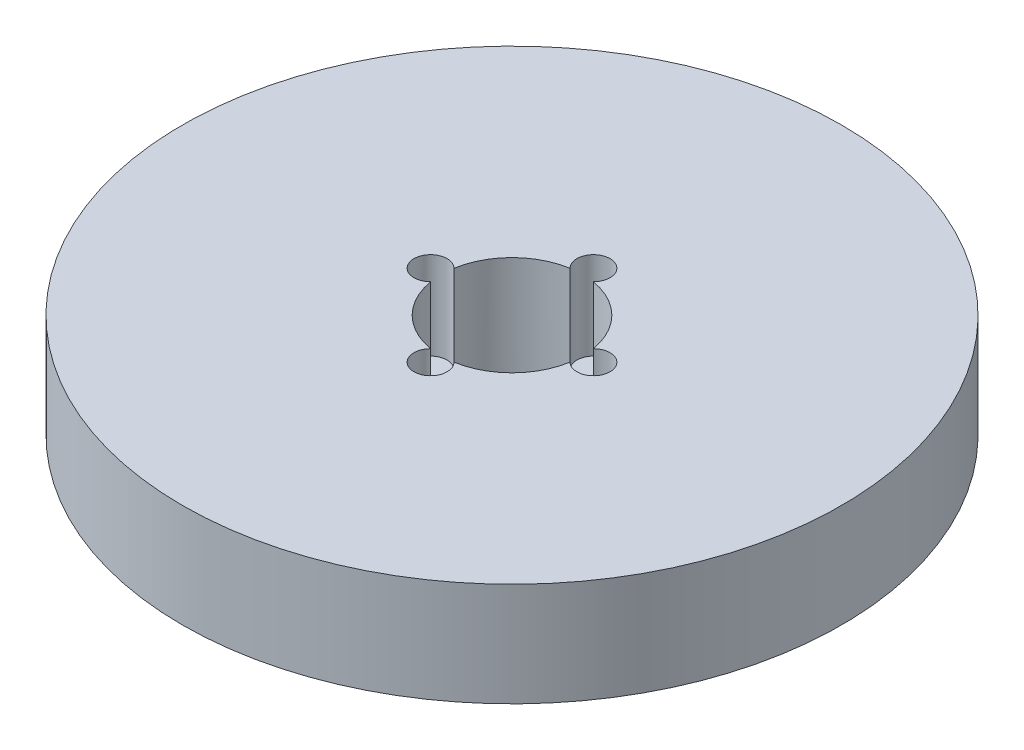
ISO-10303-21;
HEADER;
FILE_DESCRIPTION(('STEP AP214'),'2;1');
FILE_NAME('part.step','',(''),(''),'','','');
FILE_SCHEMA(('AUTOMOTIVE_DESIGN { 1 0 10303 214 1 1 1 1 }'));
ENDSEC;
DATA;
#1=APPLICATION_CONTEXT('core data for automotive mechanical design processes');
#2=APPLICATION_PROTOCOL_DEFINITION('international standard','automotive_design',2000,#1);
#3=PRODUCT_CONTEXT('',#1,'mechanical');
#4=PRODUCT('Part','Part','',(#3));
#5=PRODUCT_RELATED_PRODUCT_CATEGORY('part','',(#4));
#6=PRODUCT_DEFINITION_FORMATION('','',#4);
#7=PRODUCT_DEFINITION_CONTEXT('part definition',#1,'design');
#8=PRODUCT_DEFINITION('design','',#6,#7);
#9=PRODUCT_DEFINITION_SHAPE('','',#8);
#10=(LENGTH_UNIT() NAMED_UNIT(*) SI_UNIT(.MILLI.,.METRE.));
#11=(NAMED_UNIT(*) PLANE_ANGLE_UNIT() SI_UNIT($,.RADIAN.));
#12=(NAMED_UNIT(*) SI_UNIT($,.STERADIAN.) SOLID_ANGLE_UNIT());
#13=UNCERTAINTY_MEASURE_WITH_UNIT(LENGTH_MEASURE(1.E-05),#10,'distance_accuracy_value','');
#14=(GEOMETRIC_REPRESENTATION_CONTEXT(3) GLOBAL_UNCERTAINTY_ASSIGNED_CONTEXT((#13)) GLOBAL_UNIT_ASSIGNED_CONTEXT((#10,
#11,#12)) REPRESENTATION_CONTEXT('',''));
#15=CARTESIAN_POINT('',(0.,0.,0.));
#16=DIRECTION('',(0.,0.,1.));
#17=DIRECTION('',(1.,0.,0.));
#18=AXIS2_PLACEMENT_3D('',#15,#16,#17);
#19=CARTESIAN_POINT('',(0.,11.,0.));
#20=DIRECTION('',(0.,-1.,0.));
#21=DIRECTION('',(0.,0.,-1.));
#22=AXIS2_PLACEMENT_3D('',#19,#20,#21);
#23=CYLINDRICAL_SURFACE('',#22,35.);
#24=CARTESIAN_POINT('',(0.,11.,0.));
#25=DIRECTION('',(0.,1.,0.));
#26=DIRECTION('',(0.,0.,1.));
#27=AXIS2_PLACEMENT_3D('',#24,#25,#26);
#28=CIRCLE('',#27,35.);
#29=CARTESIAN_POINT('',(0.,11.,35.));
#30=VERTEX_POINT('',#29);
#31=EDGE_CURVE('E145',#30,#30,#28,.T.);
#32=ORIENTED_EDGE('',*,*,#31,.F.);
#33=EDGE_LOOP('',(#32));
#34=FACE_BOUND('',#33,.T.);
#35=CARTESIAN_POINT('',(0.,0.,0.));
#36=DIRECTION('',(0.,1.,0.));
#37=DIRECTION('',(0.,0.,1.));
#38=AXIS2_PLACEMENT_3D('',#35,#36,#37);
#39=CIRCLE('',#38,35.);
#40=CARTESIAN_POINT('',(0.,0.,35.));
#41=VERTEX_POINT('',#40);
#42=EDGE_CURVE('E143',#41,#41,#39,.T.);
#43=ORIENTED_EDGE('',*,*,#42,.T.);
#44=EDGE_LOOP('',(#43));
#45=FACE_BOUND('',#44,.T.);
#46=ADVANCED_FACE('F39',(#34,#45),#23,.T.);
#47=CARTESIAN_POINT('',(0.,11.,0.));
#48=DIRECTION('',(0.,1.,0.));
#49=DIRECTION('',(0.,0.,1.));
#50=AXIS2_PLACEMENT_3D('',#47,#48,#49);
#51=PLANE('',#50);
#52=CARTESIAN_POINT('',(0.,11.,8.65115023259177));
#53=DIRECTION('',(0.,1.,0.));
#54=DIRECTION('',(1.,0.,0.));
#55=AXIS2_PLACEMENT_3D('',#52,#53,#54);
#56=CIRCLE('',#55,1.76008255261456);
#57=CARTESIAN_POINT('',(-1.23545911222508,11.,7.39754288815009));
#58=VERTEX_POINT('',#57);
#59=CARTESIAN_POINT('',(1.23545911222513,11.,7.39754288815008));
#60=VERTEX_POINT('',#59);
#61=EDGE_CURVE('E152',#58,#60,#56,.T.);
#62=ORIENTED_EDGE('',*,*,#61,.F.);
#63=CARTESIAN_POINT('',(0.,11.,0.));
#64=DIRECTION('',(0.,1.,0.));
#65=DIRECTION('',(0.,0.,1.));
#66=AXIS2_PLACEMENT_3D('',#63,#64,#65);
#67=CIRCLE('',#66,7.5);
#68=CARTESIAN_POINT('',(-7.39754288815009,11.,1.2354591122251));
#69=VERTEX_POINT('',#68);
#70=EDGE_CURVE('E133',#69,#58,#67,.T.);
#71=ORIENTED_EDGE('',*,*,#70,.F.);
#72=CARTESIAN_POINT('',(-8.65115023259177,11.,0.));
#73=DIRECTION('',(0.,1.,0.));
#74=DIRECTION('',(0.,0.,1.));
#75=AXIS2_PLACEMENT_3D('',#72,#73,#74);
#76=CIRCLE('',#75,1.76008255261456);
#77=CARTESIAN_POINT('',(-7.39754288815009,11.,-1.2354591122251));
#78=VERTEX_POINT('',#77);
#79=EDGE_CURVE('E128',#78,#69,#76,.T.);
#80=ORIENTED_EDGE('',*,*,#79,.F.);
#81=CARTESIAN_POINT('',(-1.23545911222518,11.,-7.39754288815008));
#82=VERTEX_POINT('',#81);
#83=EDGE_CURVE('E121',#82,#78,#67,.T.);
#84=ORIENTED_EDGE('',*,*,#83,.F.);
#85=CARTESIAN_POINT('',(0.,11.,-8.65115023259177));
#86=DIRECTION('',(0.,1.,0.));
#87=DIRECTION('',(-1.,0.,0.));
#88=AXIS2_PLACEMENT_3D('',#85,#86,#87);
#89=CIRCLE('',#88,1.76008255261456);
#90=CARTESIAN_POINT('',(1.23545911222503,11.,-7.3975428881501));
#91=VERTEX_POINT('',#90);
#92=EDGE_CURVE('E105',#91,#82,#89,.T.);
#93=ORIENTED_EDGE('',*,*,#92,.F.);
#94=CARTESIAN_POINT('',(7.39754288815009,11.,-1.2354591122251));
#95=VERTEX_POINT('',#94);
#96=EDGE_CURVE('E131',#95,#91,#67,.T.);
#97=ORIENTED_EDGE('',*,*,#96,.F.);
#98=CARTESIAN_POINT('',(8.65115023259177,11.,0.));
#99=DIRECTION('',(0.,1.,0.));
#100=DIRECTION('',(0.,0.,-1.));
#101=AXIS2_PLACEMENT_3D('',#98,#99,#100);
#102=CIRCLE('',#101,1.76008255261456);
#103=CARTESIAN_POINT('',(7.39754288815009,11.,1.2354591122251));
#104=VERTEX_POINT('',#103);
#105=EDGE_CURVE('E154',#104,#95,#102,.T.);
#106=ORIENTED_EDGE('',*,*,#105,.F.);
#107=EDGE_CURVE('E134',#60,#104,#67,.T.);
#108=ORIENTED_EDGE('',*,*,#107,.F.);
#109=EDGE_LOOP('',(#62,#71,#80,#84,#93,#97,#106,#108));
#110=FACE_BOUND('',#109,.T.);
#111=ORIENTED_EDGE('',*,*,#31,.T.);
#112=EDGE_LOOP('',(#111));
#113=FACE_BOUND('',#112,.T.);
#114=ADVANCED_FACE('F130',(#110,#113),#51,.T.);
#115=CARTESIAN_POINT('',(0.,0.,0.));
#116=DIRECTION('',(0.,1.,0.));
#117=DIRECTION('',(0.,0.,1.));
#118=AXIS2_PLACEMENT_3D('',#115,#116,#117);
#119=PLANE('',#118);
#120=CARTESIAN_POINT('',(0.,0.,0.));
#121=DIRECTION('',(0.,1.,0.));
#122=DIRECTION('',(0.,0.,1.));
#123=AXIS2_PLACEMENT_3D('',#120,#121,#122);
#124=CIRCLE('',#123,7.5);
#125=CARTESIAN_POINT('',(0.,0.,7.5));
#126=VERTEX_POINT('',#125);
#127=EDGE_CURVE('E135',#126,#126,#124,.T.);
#128=ORIENTED_EDGE('',*,*,#127,.T.);
#129=EDGE_LOOP('',(#128));
#130=FACE_BOUND('',#129,.T.);
#131=ORIENTED_EDGE('',*,*,#42,.F.);
#132=EDGE_LOOP('',(#131));
#133=FACE_BOUND('',#132,.T.);
#134=ADVANCED_FACE('F195',(#130,#133),#119,.F.);
#135=CARTESIAN_POINT('',(0.,11.,0.));
#136=DIRECTION('',(0.,-1.,0.));
#137=DIRECTION('',(0.,0.,-1.));
#138=AXIS2_PLACEMENT_3D('',#135,#136,#137);
#139=CYLINDRICAL_SURFACE('',#138,7.5);
#140=DIRECTION('',(0.,1.,0.));
#141=VECTOR('',#140,1.);
#142=CARTESIAN_POINT('',(-1.23545911222507,6.33450097594222,7.39754288815009));
#143=LINE('',#142,#141);
#144=CARTESIAN_POINT('',(-1.23545911222508,1.66900195188444,7.39754288815009));
#145=VERTEX_POINT('',#144);
#146=EDGE_CURVE('E11',#145,#58,#143,.T.);
#147=ORIENTED_EDGE('',*,*,#146,.F.);
#148=CARTESIAN_POINT('',(0.,1.66900195188444,0.));
#149=DIRECTION('',(0.,1.,0.));
#150=DIRECTION('',(0.,0.,1.));
#151=AXIS2_PLACEMENT_3D('',#148,#149,#150);
#152=CIRCLE('',#151,7.5);
#153=CARTESIAN_POINT('',(1.23545911222513,1.66900195188444,7.39754288815008));
#154=VERTEX_POINT('',#153);
#155=EDGE_CURVE('E169',#145,#154,#152,.T.);
#156=ORIENTED_EDGE('',*,*,#155,.T.);
#157=DIRECTION('',(0.,1.,0.));
#158=VECTOR('',#157,1.);
#159=CARTESIAN_POINT('',(1.23545911222513,6.33450097594222,7.39754288815008));
#160=LINE('',#159,#158);
#161=EDGE_CURVE('E46',#60,#154,#160,.F.);
#162=ORIENTED_EDGE('',*,*,#161,.F.);
#163=ORIENTED_EDGE('',*,*,#107,.T.);
#164=DIRECTION('',(0.,1.,0.));
#165=VECTOR('',#164,1.);
#166=CARTESIAN_POINT('',(7.39754288815009,6.33450097594222,1.2354591122251));
#167=LINE('',#166,#165);
#168=CARTESIAN_POINT('',(7.39754288815009,1.66900195188444,1.2354591122251));
#169=VERTEX_POINT('',#168);
#170=EDGE_CURVE('E151',#169,#104,#167,.T.);
#171=ORIENTED_EDGE('',*,*,#170,.F.);
#172=CARTESIAN_POINT('',(0.,1.66900195188444,0.));
#173=DIRECTION('',(0.,1.,0.));
#174=DIRECTION('',(0.,0.,1.));
#175=AXIS2_PLACEMENT_3D('',#172,#173,#174);
#176=CIRCLE('',#175,7.5);
#177=CARTESIAN_POINT('',(7.39754288815009,1.66900195188444,-1.2354591122251));
#178=VERTEX_POINT('',#177);
#179=EDGE_CURVE('E173',#169,#178,#176,.T.);
#180=ORIENTED_EDGE('',*,*,#179,.T.);
#181=DIRECTION('',(0.,1.,0.));
#182=VECTOR('',#181,1.);
#183=CARTESIAN_POINT('',(7.39754288815009,6.33450097594222,-1.2354591122251));
#184=LINE('',#183,#182);
#185=EDGE_CURVE('E168',#95,#178,#184,.F.);
#186=ORIENTED_EDGE('',*,*,#185,.F.);
#187=ORIENTED_EDGE('',*,*,#96,.T.);
#188=DIRECTION('',(0.,1.,0.));
#189=VECTOR('',#188,1.);
#190=CARTESIAN_POINT('',(1.23545911222502,6.33450097594222,-7.3975428881501));
#191=LINE('',#190,#189);
#192=CARTESIAN_POINT('',(1.23545911222503,1.66900195188444,-7.3975428881501));
#193=VERTEX_POINT('',#192);
#194=EDGE_CURVE('E108',#193,#91,#191,.T.);
#195=ORIENTED_EDGE('',*,*,#194,.F.);
#196=CARTESIAN_POINT('',(0.,1.66900195188444,0.));
#197=DIRECTION('',(0.,1.,0.));
#198=DIRECTION('',(0.,0.,1.));
#199=AXIS2_PLACEMENT_3D('',#196,#197,#198);
#200=CIRCLE('',#199,7.5);
#201=CARTESIAN_POINT('',(-1.23545911222518,1.66900195188444,-7.39754288815008));
#202=VERTEX_POINT('',#201);
#203=EDGE_CURVE('E122',#193,#202,#200,.T.);
#204=ORIENTED_EDGE('',*,*,#203,.T.);
#205=DIRECTION('',(0.,1.,0.));
#206=VECTOR('',#205,1.);
#207=CARTESIAN_POINT('',(-1.23545911222518,6.33450097594222,-7.39754288815007));
#208=LINE('',#207,#206);
#209=EDGE_CURVE('E106',#82,#202,#208,.F.);
#210=ORIENTED_EDGE('',*,*,#209,.F.);
#211=ORIENTED_EDGE('',*,*,#83,.T.);
#212=DIRECTION('',(0.,1.,0.));
#213=VECTOR('',#212,1.);
#214=CARTESIAN_POINT('',(-7.39754288815009,6.33450097594222,-1.2354591122251));
#215=LINE('',#214,#213);
#216=CARTESIAN_POINT('',(-7.39754288815009,1.66900195188444,-1.2354591122251));
#217=VERTEX_POINT('',#216);
#218=EDGE_CURVE('E177',#217,#78,#215,.T.);
#219=ORIENTED_EDGE('',*,*,#218,.F.);
#220=CARTESIAN_POINT('',(0.,1.66900195188444,0.));
#221=DIRECTION('',(0.,1.,0.));
#222=DIRECTION('',(0.,0.,1.));
#223=AXIS2_PLACEMENT_3D('',#220,#221,#222);
#224=CIRCLE('',#223,7.5);
#225=CARTESIAN_POINT('',(-7.39754288815009,1.66900195188444,1.2354591122251));
#226=VERTEX_POINT('',#225);
#227=EDGE_CURVE('E185',#217,#226,#224,.T.);
#228=ORIENTED_EDGE('',*,*,#227,.T.);
#229=DIRECTION('',(0.,1.,0.));
#230=VECTOR('',#229,1.);
#231=CARTESIAN_POINT('',(-7.39754288815009,6.33450097594222,1.2354591122251));
#232=LINE('',#231,#230);
#233=EDGE_CURVE('E179',#69,#226,#232,.F.);
#234=ORIENTED_EDGE('',*,*,#233,.F.);
#235=ORIENTED_EDGE('',*,*,#70,.T.);
#236=EDGE_LOOP('',(#147,#156,#162,#163,#171,#180,#186,#187,#195,#204,#210,#211,#219,#228,#234,#235));
#237=FACE_BOUND('',#236,.T.);
#238=ORIENTED_EDGE('',*,*,#127,.F.);
#239=EDGE_LOOP('',(#238));
#240=FACE_BOUND('',#239,.T.);
#241=ADVANCED_FACE('F117',(#237,#240),#139,.F.);
#242=CARTESIAN_POINT('',(-8.65115023259177,1.66900195188444,0.));
#243=DIRECTION('',(0.,1.,0.));
#244=DIRECTION('',(0.,0.,1.));
#245=AXIS2_PLACEMENT_3D('',#242,#243,#244);
#246=CYLINDRICAL_SURFACE('',#245,1.76008255261456);
#247=ORIENTED_EDGE('',*,*,#218,.T.);
#248=ORIENTED_EDGE('',*,*,#79,.T.);
#249=ORIENTED_EDGE('',*,*,#233,.T.);
#250=CARTESIAN_POINT('',(-8.65115023259177,1.66900195188444,0.));
#251=DIRECTION('',(0.,1.,0.));
#252=DIRECTION('',(0.,0.,1.));
#253=AXIS2_PLACEMENT_3D('',#250,#251,#252);
#254=CIRCLE('',#253,1.76008255261456);
#255=EDGE_CURVE('E140',#217,#226,#254,.T.);
#256=ORIENTED_EDGE('',*,*,#255,.F.);
#257=EDGE_LOOP('',(#247,#248,#249,#256));
#258=FACE_BOUND('',#257,.T.);
#259=ADVANCED_FACE('F200',(#258),#246,.F.);
#260=CARTESIAN_POINT('',(-8.65115023259177,1.66900195188444,0.));
#261=DIRECTION('',(0.,1.,0.));
#262=DIRECTION('',(0.,0.,1.));
#263=AXIS2_PLACEMENT_3D('',#260,#261,#262);
#264=PLANE('',#263);
#265=ORIENTED_EDGE('',*,*,#255,.T.);
#266=ORIENTED_EDGE('',*,*,#227,.F.);
#267=EDGE_LOOP('',(#265,#266));
#268=FACE_BOUND('',#267,.T.);
#269=ADVANCED_FACE('F202',(#268),#264,.T.);
#270=CARTESIAN_POINT('',(0.,1.66900195188444,-8.65115023259177));
#271=DIRECTION('',(0.,1.,0.));
#272=DIRECTION('',(0.,0.,1.));
#273=AXIS2_PLACEMENT_3D('',#270,#271,#272);
#274=CYLINDRICAL_SURFACE('',#273,1.76008255261456);
#275=ORIENTED_EDGE('',*,*,#194,.T.);
#276=ORIENTED_EDGE('',*,*,#92,.T.);
#277=ORIENTED_EDGE('',*,*,#209,.T.);
#278=CARTESIAN_POINT('',(0.,1.66900195188444,-8.65115023259177));
#279=DIRECTION('',(0.,1.,0.));
#280=DIRECTION('',(-1.,0.,0.));
#281=AXIS2_PLACEMENT_3D('',#278,#279,#280);
#282=CIRCLE('',#281,1.76008255261456);
#283=EDGE_CURVE('E111',#193,#202,#282,.T.);
#284=ORIENTED_EDGE('',*,*,#283,.F.);
#285=EDGE_LOOP('',(#275,#276,#277,#284));
#286=FACE_BOUND('',#285,.T.);
#287=ADVANCED_FACE('F102',(#286),#274,.F.);
#288=CARTESIAN_POINT('',(0.,1.66900195188444,-8.65115023259177));
#289=DIRECTION('',(0.,1.,0.));
#290=DIRECTION('',(-1.,0.,0.));
#291=AXIS2_PLACEMENT_3D('',#288,#289,#290);
#292=PLANE('',#291);
#293=ORIENTED_EDGE('',*,*,#283,.T.);
#294=ORIENTED_EDGE('',*,*,#203,.F.);
#295=EDGE_LOOP('',(#293,#294));
#296=FACE_BOUND('',#295,.T.);
#297=ADVANCED_FACE('F211',(#296),#292,.T.);
#298=CARTESIAN_POINT('',(8.65115023259177,1.66900195188444,0.));
#299=DIRECTION('',(0.,1.,0.));
#300=DIRECTION('',(0.,0.,1.));
#301=AXIS2_PLACEMENT_3D('',#298,#299,#300);
#302=CYLINDRICAL_SURFACE('',#301,1.76008255261456);
#303=ORIENTED_EDGE('',*,*,#170,.T.);
#304=ORIENTED_EDGE('',*,*,#105,.T.);
#305=ORIENTED_EDGE('',*,*,#185,.T.);
#306=CARTESIAN_POINT('',(8.65115023259177,1.66900195188444,0.));
#307=DIRECTION('',(0.,1.,0.));
#308=DIRECTION('',(0.,0.,-1.));
#309=AXIS2_PLACEMENT_3D('',#306,#307,#308);
#310=CIRCLE('',#309,1.76008255261456);
#311=EDGE_CURVE('E56',#169,#178,#310,.T.);
#312=ORIENTED_EDGE('',*,*,#311,.F.);
#313=EDGE_LOOP('',(#303,#304,#305,#312));
#314=FACE_BOUND('',#313,.T.);
#315=ADVANCED_FACE('F212',(#314),#302,.F.);
#316=CARTESIAN_POINT('',(8.65115023259177,1.66900195188444,0.));
#317=DIRECTION('',(0.,1.,0.));
#318=DIRECTION('',(0.,0.,-1.));
#319=AXIS2_PLACEMENT_3D('',#316,#317,#318);
#320=PLANE('',#319);
#321=ORIENTED_EDGE('',*,*,#311,.T.);
#322=ORIENTED_EDGE('',*,*,#179,.F.);
#323=EDGE_LOOP('',(#321,#322));
#324=FACE_BOUND('',#323,.T.);
#325=ADVANCED_FACE('F217',(#324),#320,.T.);
#326=CARTESIAN_POINT('',(0.,1.66900195188444,8.65115023259177));
#327=DIRECTION('',(0.,1.,0.));
#328=DIRECTION('',(0.,0.,1.));
#329=AXIS2_PLACEMENT_3D('',#326,#327,#328);
#330=CYLINDRICAL_SURFACE('',#329,1.76008255261456);
#331=ORIENTED_EDGE('',*,*,#146,.T.);
#332=ORIENTED_EDGE('',*,*,#61,.T.);
#333=ORIENTED_EDGE('',*,*,#161,.T.);
#334=CARTESIAN_POINT('',(0.,1.66900195188444,8.65115023259177));
#335=DIRECTION('',(0.,1.,0.));
#336=DIRECTION('',(1.,0.,0.));
#337=AXIS2_PLACEMENT_3D('',#334,#335,#336);
#338=CIRCLE('',#337,1.76008255261456);
#339=EDGE_CURVE('E55',#145,#154,#338,.T.);
#340=ORIENTED_EDGE('',*,*,#339,.F.);
#341=EDGE_LOOP('',(#331,#332,#333,#340));
#342=FACE_BOUND('',#341,.T.);
#343=ADVANCED_FACE('F170',(#342),#330,.F.);
#344=CARTESIAN_POINT('',(0.,1.66900195188444,8.65115023259177));
#345=DIRECTION('',(0.,1.,0.));
#346=DIRECTION('',(1.,0.,0.));
#347=AXIS2_PLACEMENT_3D('',#344,#345,#346);
#348=PLANE('',#347);
#349=ORIENTED_EDGE('',*,*,#339,.T.);
#350=ORIENTED_EDGE('',*,*,#155,.F.);
#351=EDGE_LOOP('',(#349,#350));
#352=FACE_BOUND('',#351,.T.);
#353=ADVANCED_FACE('F224',(#352),#348,.T.);
#354=CLOSED_SHELL('',(#46,#114,#134,#241,#259,#269,#287,#297,#315,#325,#343,#353));
#355=MANIFOLD_SOLID_BREP('B2',#354);
#356=ADVANCED_BREP_SHAPE_REPRESENTATION('',(#18,#355),#14);
#357=SHAPE_DEFINITION_REPRESENTATION(#9,#356);
ENDSEC;
END-ISO-10303-21;
